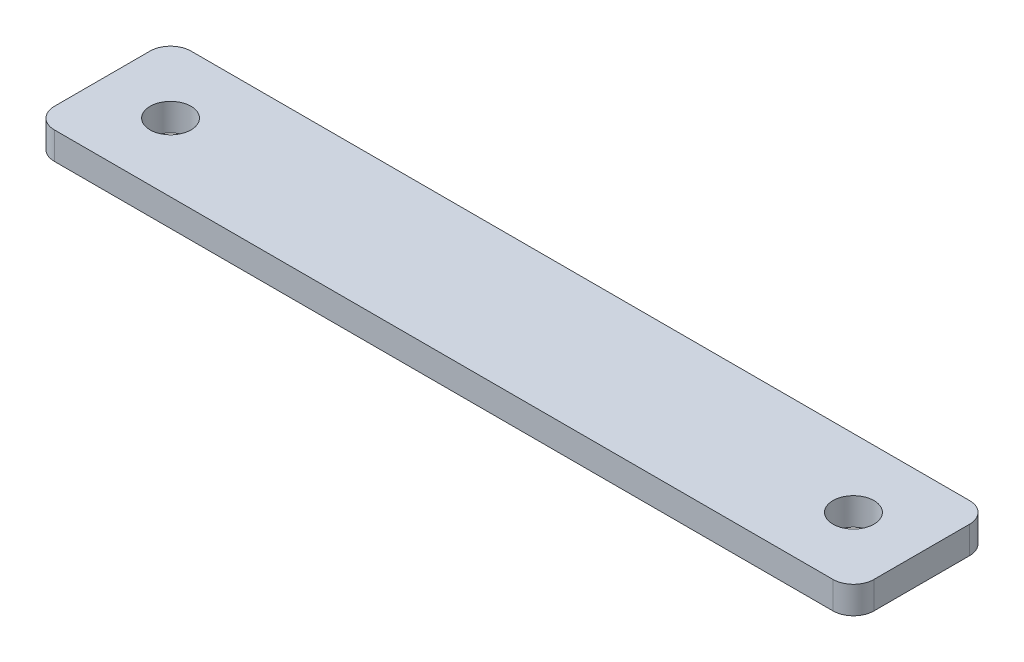
ISO-10303-21;
HEADER;
FILE_DESCRIPTION(('STEP AP214'),'2;1');
FILE_NAME('part.step','',(''),(''),'','','');
FILE_SCHEMA(('AUTOMOTIVE_DESIGN { 1 0 10303 214 1 1 1 1 }'));
ENDSEC;
DATA;
#1=APPLICATION_CONTEXT('core data for automotive mechanical design processes');
#2=APPLICATION_PROTOCOL_DEFINITION('international standard','automotive_design',2000,#1);
#3=PRODUCT_CONTEXT('',#1,'mechanical');
#4=PRODUCT('Part','Part','',(#3));
#5=PRODUCT_RELATED_PRODUCT_CATEGORY('part','',(#4));
#6=PRODUCT_DEFINITION_FORMATION('','',#4);
#7=PRODUCT_DEFINITION_CONTEXT('part definition',#1,'design');
#8=PRODUCT_DEFINITION('design','',#6,#7);
#9=PRODUCT_DEFINITION_SHAPE('','',#8);
#10=(LENGTH_UNIT() NAMED_UNIT(*) SI_UNIT(.MILLI.,.METRE.));
#11=(NAMED_UNIT(*) PLANE_ANGLE_UNIT() SI_UNIT($,.RADIAN.));
#12=(NAMED_UNIT(*) SI_UNIT($,.STERADIAN.) SOLID_ANGLE_UNIT());
#13=UNCERTAINTY_MEASURE_WITH_UNIT(LENGTH_MEASURE(1.E-05),#10,'distance_accuracy_value','');
#14=(GEOMETRIC_REPRESENTATION_CONTEXT(3) GLOBAL_UNCERTAINTY_ASSIGNED_CONTEXT((#13)) GLOBAL_UNIT_ASSIGNED_CONTEXT((#10,
#11,#12)) REPRESENTATION_CONTEXT('',''));
#15=CARTESIAN_POINT('',(0.,0.,0.));
#16=DIRECTION('',(0.,0.,1.));
#17=DIRECTION('',(1.,0.,0.));
#18=AXIS2_PLACEMENT_3D('',#15,#16,#17);
#19=CARTESIAN_POINT('',(60.,4.,10.));
#20=DIRECTION('',(-1.,0.,0.));
#21=DIRECTION('',(0.,0.,1.));
#22=AXIS2_PLACEMENT_3D('',#19,#20,#21);
#23=PLANE('',#22);
#24=DIRECTION('',(0.,0.,-1.));
#25=VECTOR('',#24,1.);
#26=CARTESIAN_POINT('',(60.,4.,10.));
#27=LINE('',#26,#25);
#28=CARTESIAN_POINT('',(60.,4.,7.));
#29=VERTEX_POINT('',#28);
#30=CARTESIAN_POINT('',(60.,4.,-7.));
#31=VERTEX_POINT('',#30);
#32=EDGE_CURVE('E127',#29,#31,#27,.T.);
#33=ORIENTED_EDGE('',*,*,#32,.F.);
#34=DIRECTION('',(0.,-1.,0.));
#35=VECTOR('',#34,1.);
#36=CARTESIAN_POINT('',(60.,4.,7.));
#37=LINE('',#36,#35);
#38=CARTESIAN_POINT('',(60.,0.,7.));
#39=VERTEX_POINT('',#38);
#40=EDGE_CURVE('E11',#29,#39,#37,.T.);
#41=ORIENTED_EDGE('',*,*,#40,.T.);
#42=DIRECTION('',(0.,0.,-1.));
#43=VECTOR('',#42,1.);
#44=CARTESIAN_POINT('',(60.,0.,10.));
#45=LINE('',#44,#43);
#46=CARTESIAN_POINT('',(60.,0.,-7.));
#47=VERTEX_POINT('',#46);
#48=EDGE_CURVE('E158',#39,#47,#45,.T.);
#49=ORIENTED_EDGE('',*,*,#48,.T.);
#50=DIRECTION('',(0.,-1.,0.));
#51=VECTOR('',#50,1.);
#52=CARTESIAN_POINT('',(60.,4.,-7.));
#53=LINE('',#52,#51);
#54=EDGE_CURVE('E41',#47,#31,#53,.F.);
#55=ORIENTED_EDGE('',*,*,#54,.T.);
#56=EDGE_LOOP('',(#33,#41,#49,#55));
#57=FACE_BOUND('',#56,.T.);
#58=ADVANCED_FACE('F33',(#57),#23,.F.);
#59=CARTESIAN_POINT('',(-60.,4.,-10.));
#60=DIRECTION('',(0.,0.,1.));
#61=DIRECTION('',(1.,0.,0.));
#62=AXIS2_PLACEMENT_3D('',#59,#60,#61);
#63=PLANE('',#62);
#64=DIRECTION('',(-1.,0.,0.));
#65=VECTOR('',#64,1.);
#66=CARTESIAN_POINT('',(-60.,0.,-10.));
#67=LINE('',#66,#65);
#68=CARTESIAN_POINT('',(57.,0.,-10.));
#69=VERTEX_POINT('',#68);
#70=CARTESIAN_POINT('',(-57.,0.,-10.));
#71=VERTEX_POINT('',#70);
#72=EDGE_CURVE('E132',#69,#71,#67,.T.);
#73=ORIENTED_EDGE('',*,*,#72,.T.);
#74=DIRECTION('',(0.,-1.,0.));
#75=VECTOR('',#74,1.);
#76=CARTESIAN_POINT('',(-57.,4.,-10.));
#77=LINE('',#76,#75);
#78=CARTESIAN_POINT('',(-57.,4.,-10.));
#79=VERTEX_POINT('',#78);
#80=EDGE_CURVE('E48',#71,#79,#77,.F.);
#81=ORIENTED_EDGE('',*,*,#80,.T.);
#82=DIRECTION('',(-1.,0.,0.));
#83=VECTOR('',#82,1.);
#84=CARTESIAN_POINT('',(-60.,4.,-10.));
#85=LINE('',#84,#83);
#86=CARTESIAN_POINT('',(57.,4.,-10.));
#87=VERTEX_POINT('',#86);
#88=EDGE_CURVE('E130',#87,#79,#85,.T.);
#89=ORIENTED_EDGE('',*,*,#88,.F.);
#90=DIRECTION('',(0.,-1.,0.));
#91=VECTOR('',#90,1.);
#92=CARTESIAN_POINT('',(57.,4.,-10.));
#93=LINE('',#92,#91);
#94=EDGE_CURVE('E150',#87,#69,#93,.T.);
#95=ORIENTED_EDGE('',*,*,#94,.T.);
#96=EDGE_LOOP('',(#73,#81,#89,#95));
#97=FACE_BOUND('',#96,.T.);
#98=ADVANCED_FACE('F165',(#97),#63,.F.);
#99=CARTESIAN_POINT('',(-60.,4.,10.));
#100=DIRECTION('',(1.,0.,0.));
#101=DIRECTION('',(0.,0.,-1.));
#102=AXIS2_PLACEMENT_3D('',#99,#100,#101);
#103=PLANE('',#102);
#104=DIRECTION('',(0.,0.,1.));
#105=VECTOR('',#104,1.);
#106=CARTESIAN_POINT('',(-60.,0.,10.));
#107=LINE('',#106,#105);
#108=CARTESIAN_POINT('',(-60.,0.,-7.));
#109=VERTEX_POINT('',#108);
#110=CARTESIAN_POINT('',(-60.,0.,7.));
#111=VERTEX_POINT('',#110);
#112=EDGE_CURVE('E128',#109,#111,#107,.T.);
#113=ORIENTED_EDGE('',*,*,#112,.T.);
#114=DIRECTION('',(0.,-1.,0.));
#115=VECTOR('',#114,1.);
#116=CARTESIAN_POINT('',(-60.,4.,7.));
#117=LINE('',#116,#115);
#118=CARTESIAN_POINT('',(-60.,4.,7.));
#119=VERTEX_POINT('',#118);
#120=EDGE_CURVE('E105',#111,#119,#117,.F.);
#121=ORIENTED_EDGE('',*,*,#120,.T.);
#122=DIRECTION('',(0.,0.,1.));
#123=VECTOR('',#122,1.);
#124=CARTESIAN_POINT('',(-60.,4.,10.));
#125=LINE('',#124,#123);
#126=CARTESIAN_POINT('',(-60.,4.,-7.));
#127=VERTEX_POINT('',#126);
#128=EDGE_CURVE('E170',#127,#119,#125,.T.);
#129=ORIENTED_EDGE('',*,*,#128,.F.);
#130=DIRECTION('',(0.,-1.,0.));
#131=VECTOR('',#130,1.);
#132=CARTESIAN_POINT('',(-60.,4.,-7.));
#133=LINE('',#132,#131);
#134=EDGE_CURVE('E110',#127,#109,#133,.T.);
#135=ORIENTED_EDGE('',*,*,#134,.T.);
#136=EDGE_LOOP('',(#113,#121,#129,#135));
#137=FACE_BOUND('',#136,.T.);
#138=ADVANCED_FACE('F212',(#137),#103,.F.);
#139=CARTESIAN_POINT('',(-60.,4.,10.));
#140=DIRECTION('',(0.,0.,-1.));
#141=DIRECTION('',(-1.,0.,0.));
#142=AXIS2_PLACEMENT_3D('',#139,#140,#141);
#143=PLANE('',#142);
#144=DIRECTION('',(1.,0.,0.));
#145=VECTOR('',#144,1.);
#146=CARTESIAN_POINT('',(-60.,4.,10.));
#147=LINE('',#146,#145);
#148=CARTESIAN_POINT('',(-57.,4.,10.));
#149=VERTEX_POINT('',#148);
#150=CARTESIAN_POINT('',(57.,4.,10.));
#151=VERTEX_POINT('',#150);
#152=EDGE_CURVE('E120',#149,#151,#147,.T.);
#153=ORIENTED_EDGE('',*,*,#152,.F.);
#154=DIRECTION('',(0.,-1.,0.));
#155=VECTOR('',#154,1.);
#156=CARTESIAN_POINT('',(-57.,4.,10.));
#157=LINE('',#156,#155);
#158=CARTESIAN_POINT('',(-57.,0.,10.));
#159=VERTEX_POINT('',#158);
#160=EDGE_CURVE('E104',#149,#159,#157,.T.);
#161=ORIENTED_EDGE('',*,*,#160,.T.);
#162=DIRECTION('',(1.,0.,0.));
#163=VECTOR('',#162,1.);
#164=CARTESIAN_POINT('',(-60.,0.,10.));
#165=LINE('',#164,#163);
#166=CARTESIAN_POINT('',(57.,0.,10.));
#167=VERTEX_POINT('',#166);
#168=EDGE_CURVE('E117',#159,#167,#165,.T.);
#169=ORIENTED_EDGE('',*,*,#168,.T.);
#170=DIRECTION('',(0.,-1.,0.));
#171=VECTOR('',#170,1.);
#172=CARTESIAN_POINT('',(57.,4.,10.));
#173=LINE('',#172,#171);
#174=EDGE_CURVE('E122',#167,#151,#173,.F.);
#175=ORIENTED_EDGE('',*,*,#174,.T.);
#176=EDGE_LOOP('',(#153,#161,#169,#175));
#177=FACE_BOUND('',#176,.T.);
#178=ADVANCED_FACE('F116',(#177),#143,.F.);
#179=CARTESIAN_POINT('',(0.,4.,0.));
#180=DIRECTION('',(0.,-1.,0.));
#181=DIRECTION('',(0.,0.,-1.));
#182=AXIS2_PLACEMENT_3D('',#179,#180,#181);
#183=PLANE('',#182);
#184=CARTESIAN_POINT('',(-50.,4.,0.));
#185=DIRECTION('',(0.,1.,0.));
#186=DIRECTION('',(0.,0.,1.));
#187=AXIS2_PLACEMENT_3D('',#184,#185,#186);
#188=CIRCLE('',#187,3.);
#189=CARTESIAN_POINT('',(-50.,4.,3.));
#190=VERTEX_POINT('',#189);
#191=EDGE_CURVE('E179',#190,#190,#188,.T.);
#192=ORIENTED_EDGE('',*,*,#191,.F.);
#193=EDGE_LOOP('',(#192));
#194=FACE_BOUND('',#193,.T.);
#195=CARTESIAN_POINT('',(50.,4.,-1.59594559789866E-13));
#196=DIRECTION('',(0.,1.,0.));
#197=DIRECTION('',(0.,0.,-1.));
#198=AXIS2_PLACEMENT_3D('',#195,#196,#197);
#199=CIRCLE('',#198,3.);
#200=CARTESIAN_POINT('',(50.,4.,-3.00000000000016));
#201=VERTEX_POINT('',#200);
#202=EDGE_CURVE('E173',#201,#201,#199,.T.);
#203=ORIENTED_EDGE('',*,*,#202,.F.);
#204=EDGE_LOOP('',(#203));
#205=FACE_BOUND('',#204,.T.);
#206=ORIENTED_EDGE('',*,*,#128,.T.);
#207=CARTESIAN_POINT('',(-57.,4.,7.));
#208=DIRECTION('',(0.,-1.,0.));
#209=DIRECTION('',(0.,0.,-1.));
#210=AXIS2_PLACEMENT_3D('',#207,#208,#209);
#211=CIRCLE('',#210,3.);
#212=EDGE_CURVE('E148',#119,#149,#211,.F.);
#213=ORIENTED_EDGE('',*,*,#212,.T.);
#214=ORIENTED_EDGE('',*,*,#152,.T.);
#215=CARTESIAN_POINT('',(57.,4.,7.));
#216=DIRECTION('',(0.,-1.,0.));
#217=DIRECTION('',(0.,0.,-1.));
#218=AXIS2_PLACEMENT_3D('',#215,#216,#217);
#219=CIRCLE('',#218,3.);
#220=EDGE_CURVE('E144',#151,#29,#219,.F.);
#221=ORIENTED_EDGE('',*,*,#220,.T.);
#222=ORIENTED_EDGE('',*,*,#32,.T.);
#223=CARTESIAN_POINT('',(57.,4.,-7.));
#224=DIRECTION('',(0.,-1.,0.));
#225=DIRECTION('',(0.,0.,-1.));
#226=AXIS2_PLACEMENT_3D('',#223,#224,#225);
#227=CIRCLE('',#226,3.);
#228=EDGE_CURVE('E55',#31,#87,#227,.F.);
#229=ORIENTED_EDGE('',*,*,#228,.T.);
#230=ORIENTED_EDGE('',*,*,#88,.T.);
#231=CARTESIAN_POINT('',(-57.,4.,-7.));
#232=DIRECTION('',(0.,-1.,0.));
#233=DIRECTION('',(0.,0.,-1.));
#234=AXIS2_PLACEMENT_3D('',#231,#232,#233);
#235=CIRCLE('',#234,3.);
#236=EDGE_CURVE('E146',#79,#127,#235,.F.);
#237=ORIENTED_EDGE('',*,*,#236,.T.);
#238=EDGE_LOOP('',(#206,#213,#214,#221,#222,#229,#230,#237));
#239=FACE_BOUND('',#238,.T.);
#240=ADVANCED_FACE('F161',(#194,#205,#239),#183,.F.);
#241=CARTESIAN_POINT('',(0.,0.,0.));
#242=DIRECTION('',(0.,-1.,0.));
#243=DIRECTION('',(0.,0.,-1.));
#244=AXIS2_PLACEMENT_3D('',#241,#242,#243);
#245=PLANE('',#244);
#246=CARTESIAN_POINT('',(-50.,0.,0.));
#247=DIRECTION('',(0.,1.,0.));
#248=DIRECTION('',(0.,0.,1.));
#249=AXIS2_PLACEMENT_3D('',#246,#247,#248);
#250=CIRCLE('',#249,3.);
#251=CARTESIAN_POINT('',(-50.,0.,3.));
#252=VERTEX_POINT('',#251);
#253=EDGE_CURVE('E166',#252,#252,#250,.T.);
#254=ORIENTED_EDGE('',*,*,#253,.T.);
#255=EDGE_LOOP('',(#254));
#256=FACE_BOUND('',#255,.T.);
#257=CARTESIAN_POINT('',(50.,0.,-1.59594559789866E-13));
#258=DIRECTION('',(0.,1.,0.));
#259=DIRECTION('',(0.,0.,-1.));
#260=AXIS2_PLACEMENT_3D('',#257,#258,#259);
#261=CIRCLE('',#260,3.);
#262=CARTESIAN_POINT('',(50.,0.,-3.00000000000016));
#263=VERTEX_POINT('',#262);
#264=EDGE_CURVE('E176',#263,#263,#261,.T.);
#265=ORIENTED_EDGE('',*,*,#264,.T.);
#266=EDGE_LOOP('',(#265));
#267=FACE_BOUND('',#266,.T.);
#268=ORIENTED_EDGE('',*,*,#168,.F.);
#269=CARTESIAN_POINT('',(-57.,0.,7.));
#270=DIRECTION('',(0.,-1.,0.));
#271=DIRECTION('',(0.,0.,-1.));
#272=AXIS2_PLACEMENT_3D('',#269,#270,#271);
#273=CIRCLE('',#272,3.);
#274=EDGE_CURVE('E100',#159,#111,#273,.T.);
#275=ORIENTED_EDGE('',*,*,#274,.T.);
#276=ORIENTED_EDGE('',*,*,#112,.F.);
#277=CARTESIAN_POINT('',(-57.,0.,-7.));
#278=DIRECTION('',(0.,-1.,0.));
#279=DIRECTION('',(0.,0.,-1.));
#280=AXIS2_PLACEMENT_3D('',#277,#278,#279);
#281=CIRCLE('',#280,3.);
#282=EDGE_CURVE('E111',#109,#71,#281,.T.);
#283=ORIENTED_EDGE('',*,*,#282,.T.);
#284=ORIENTED_EDGE('',*,*,#72,.F.);
#285=CARTESIAN_POINT('',(57.,0.,-7.));
#286=DIRECTION('',(0.,-1.,0.));
#287=DIRECTION('',(0.,0.,-1.));
#288=AXIS2_PLACEMENT_3D('',#285,#286,#287);
#289=CIRCLE('',#288,3.);
#290=EDGE_CURVE('E121',#69,#47,#289,.T.);
#291=ORIENTED_EDGE('',*,*,#290,.T.);
#292=ORIENTED_EDGE('',*,*,#48,.F.);
#293=CARTESIAN_POINT('',(57.,0.,7.));
#294=DIRECTION('',(0.,-1.,0.));
#295=DIRECTION('',(0.,0.,-1.));
#296=AXIS2_PLACEMENT_3D('',#293,#294,#295);
#297=CIRCLE('',#296,3.);
#298=EDGE_CURVE('E126',#39,#167,#297,.T.);
#299=ORIENTED_EDGE('',*,*,#298,.T.);
#300=EDGE_LOOP('',(#268,#275,#276,#283,#284,#291,#292,#299));
#301=FACE_BOUND('',#300,.T.);
#302=ADVANCED_FACE('F124',(#256,#267,#301),#245,.T.);
#303=CARTESIAN_POINT('',(50.,0.,-1.59594559789866E-13));
#304=DIRECTION('',(0.,1.,0.));
#305=DIRECTION('',(0.,0.,1.));
#306=AXIS2_PLACEMENT_3D('',#303,#304,#305);
#307=CYLINDRICAL_SURFACE('',#306,3.);
#308=ORIENTED_EDGE('',*,*,#264,.F.);
#309=EDGE_LOOP('',(#308));
#310=FACE_BOUND('',#309,.T.);
#311=ORIENTED_EDGE('',*,*,#202,.T.);
#312=EDGE_LOOP('',(#311));
#313=FACE_BOUND('',#312,.T.);
#314=ADVANCED_FACE('F190',(#310,#313),#307,.F.);
#315=CARTESIAN_POINT('',(-50.,0.,0.));
#316=DIRECTION('',(0.,1.,0.));
#317=DIRECTION('',(0.,0.,1.));
#318=AXIS2_PLACEMENT_3D('',#315,#316,#317);
#319=CYLINDRICAL_SURFACE('',#318,3.);
#320=ORIENTED_EDGE('',*,*,#253,.F.);
#321=EDGE_LOOP('',(#320));
#322=FACE_BOUND('',#321,.T.);
#323=ORIENTED_EDGE('',*,*,#191,.T.);
#324=EDGE_LOOP('',(#323));
#325=FACE_BOUND('',#324,.T.);
#326=ADVANCED_FACE('F187',(#322,#325),#319,.F.);
#327=CARTESIAN_POINT('',(-57.,4.,7.));
#328=DIRECTION('',(0.,-1.,0.));
#329=DIRECTION('',(0.,0.,-1.));
#330=AXIS2_PLACEMENT_3D('',#327,#328,#329);
#331=CYLINDRICAL_SURFACE('',#330,3.);
#332=ORIENTED_EDGE('',*,*,#212,.F.);
#333=ORIENTED_EDGE('',*,*,#120,.F.);
#334=ORIENTED_EDGE('',*,*,#274,.F.);
#335=ORIENTED_EDGE('',*,*,#160,.F.);
#336=EDGE_LOOP('',(#332,#333,#334,#335));
#337=FACE_BOUND('',#336,.T.);
#338=ADVANCED_FACE('F103',(#337),#331,.T.);
#339=CARTESIAN_POINT('',(-57.,4.,-7.));
#340=DIRECTION('',(0.,-1.,0.));
#341=DIRECTION('',(0.,0.,-1.));
#342=AXIS2_PLACEMENT_3D('',#339,#340,#341);
#343=CYLINDRICAL_SURFACE('',#342,3.);
#344=ORIENTED_EDGE('',*,*,#236,.F.);
#345=ORIENTED_EDGE('',*,*,#80,.F.);
#346=ORIENTED_EDGE('',*,*,#282,.F.);
#347=ORIENTED_EDGE('',*,*,#134,.F.);
#348=EDGE_LOOP('',(#344,#345,#346,#347));
#349=FACE_BOUND('',#348,.T.);
#350=ADVANCED_FACE('F218',(#349),#343,.T.);
#351=CARTESIAN_POINT('',(57.,4.,7.));
#352=DIRECTION('',(0.,-1.,0.));
#353=DIRECTION('',(0.,0.,-1.));
#354=AXIS2_PLACEMENT_3D('',#351,#352,#353);
#355=CYLINDRICAL_SURFACE('',#354,3.);
#356=ORIENTED_EDGE('',*,*,#220,.F.);
#357=ORIENTED_EDGE('',*,*,#174,.F.);
#358=ORIENTED_EDGE('',*,*,#298,.F.);
#359=ORIENTED_EDGE('',*,*,#40,.F.);
#360=EDGE_LOOP('',(#356,#357,#358,#359));
#361=FACE_BOUND('',#360,.T.);
#362=ADVANCED_FACE('F220',(#361),#355,.T.);
#363=CARTESIAN_POINT('',(57.,4.,-7.));
#364=DIRECTION('',(0.,-1.,0.));
#365=DIRECTION('',(0.,0.,-1.));
#366=AXIS2_PLACEMENT_3D('',#363,#364,#365);
#367=CYLINDRICAL_SURFACE('',#366,3.);
#368=ORIENTED_EDGE('',*,*,#228,.F.);
#369=ORIENTED_EDGE('',*,*,#54,.F.);
#370=ORIENTED_EDGE('',*,*,#290,.F.);
#371=ORIENTED_EDGE('',*,*,#94,.F.);
#372=EDGE_LOOP('',(#368,#369,#370,#371));
#373=FACE_BOUND('',#372,.T.);
#374=ADVANCED_FACE('F35',(#373),#367,.T.);
#375=CLOSED_SHELL('',(#58,#98,#138,#178,#240,#302,#314,#326,#338,#350,#362,#374));
#376=MANIFOLD_SOLID_BREP('B2',#375);
#377=ADVANCED_BREP_SHAPE_REPRESENTATION('',(#18,#376),#14);
#378=SHAPE_DEFINITION_REPRESENTATION(#9,#377);
ENDSEC;
END-ISO-10303-21;
